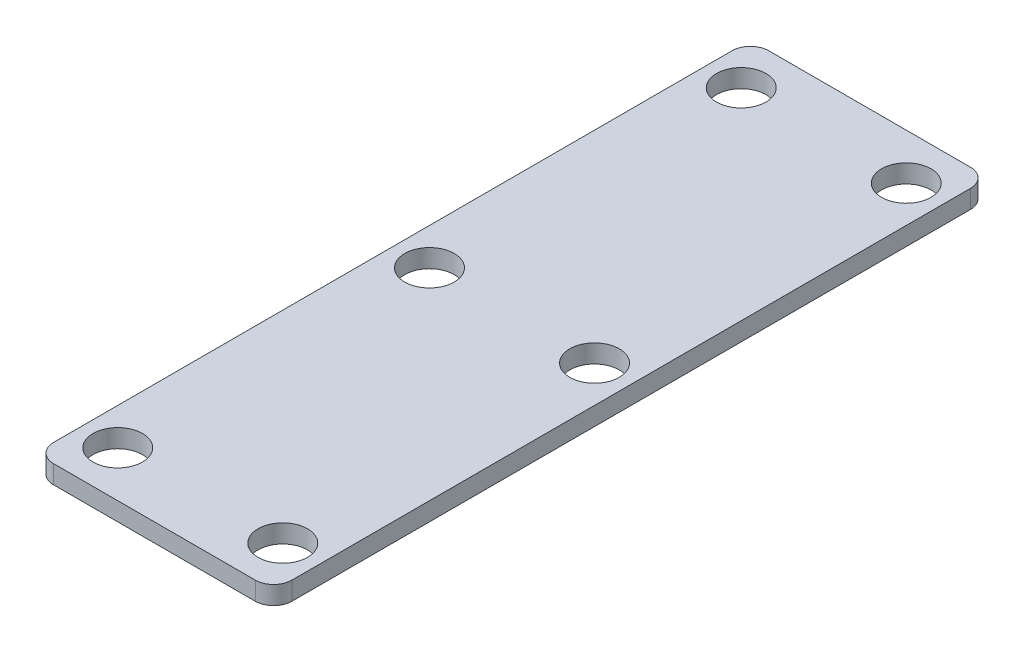
ISO-10303-21;
HEADER;
FILE_DESCRIPTION(('STEP AP214'),'2;1');
FILE_NAME('part.step','',(''),(''),'','','');
FILE_SCHEMA(('AUTOMOTIVE_DESIGN { 1 0 10303 214 1 1 1 1 }'));
ENDSEC;
DATA;
#1=APPLICATION_CONTEXT('core data for automotive mechanical design processes');
#2=APPLICATION_PROTOCOL_DEFINITION('international standard','automotive_design',2000,#1);
#3=PRODUCT_CONTEXT('',#1,'mechanical');
#4=PRODUCT('Part','Part','',(#3));
#5=PRODUCT_RELATED_PRODUCT_CATEGORY('part','',(#4));
#6=PRODUCT_DEFINITION_FORMATION('','',#4);
#7=PRODUCT_DEFINITION_CONTEXT('part definition',#1,'design');
#8=PRODUCT_DEFINITION('design','',#6,#7);
#9=PRODUCT_DEFINITION_SHAPE('','',#8);
#10=(LENGTH_UNIT() NAMED_UNIT(*) SI_UNIT(.MILLI.,.METRE.));
#11=(NAMED_UNIT(*) PLANE_ANGLE_UNIT() SI_UNIT($,.RADIAN.));
#12=(NAMED_UNIT(*) SI_UNIT($,.STERADIAN.) SOLID_ANGLE_UNIT());
#13=UNCERTAINTY_MEASURE_WITH_UNIT(LENGTH_MEASURE(1.E-05),#10,'distance_accuracy_value','');
#14=(GEOMETRIC_REPRESENTATION_CONTEXT(3) GLOBAL_UNCERTAINTY_ASSIGNED_CONTEXT((#13)) GLOBAL_UNIT_ASSIGNED_CONTEXT((#10,
#11,#12)) REPRESENTATION_CONTEXT('',''));
#15=CARTESIAN_POINT('',(0.,0.,0.));
#16=DIRECTION('',(0.,0.,1.));
#17=DIRECTION('',(1.,0.,0.));
#18=AXIS2_PLACEMENT_3D('',#15,#16,#17);
#19=CARTESIAN_POINT('',(6.5,1.,19.5));
#20=DIRECTION('',(-1.,0.,0.));
#21=DIRECTION('',(0.,0.,1.));
#22=AXIS2_PLACEMENT_3D('',#19,#20,#21);
#23=PLANE('',#22);
#24=DIRECTION('',(0.,0.,-1.));
#25=VECTOR('',#24,1.);
#26=CARTESIAN_POINT('',(6.5,1.,19.5));
#27=LINE('',#26,#25);
#28=CARTESIAN_POINT('',(6.5,1.,18.5));
#29=VERTEX_POINT('',#28);
#30=CARTESIAN_POINT('',(6.5,1.,-18.5));
#31=VERTEX_POINT('',#30);
#32=EDGE_CURVE('E127',#29,#31,#27,.T.);
#33=ORIENTED_EDGE('',*,*,#32,.F.);
#34=DIRECTION('',(0.,-1.,0.));
#35=VECTOR('',#34,1.);
#36=CARTESIAN_POINT('',(6.5,1.,18.5));
#37=LINE('',#36,#35);
#38=CARTESIAN_POINT('',(6.5,0.,18.5));
#39=VERTEX_POINT('',#38);
#40=EDGE_CURVE('E153',#29,#39,#37,.T.);
#41=ORIENTED_EDGE('',*,*,#40,.T.);
#42=DIRECTION('',(0.,0.,-1.));
#43=VECTOR('',#42,1.);
#44=CARTESIAN_POINT('',(6.5,0.,19.5));
#45=LINE('',#44,#43);
#46=CARTESIAN_POINT('',(6.5,0.,-18.5));
#47=VERTEX_POINT('',#46);
#48=EDGE_CURVE('E159',#39,#47,#45,.T.);
#49=ORIENTED_EDGE('',*,*,#48,.T.);
#50=DIRECTION('',(0.,-1.,0.));
#51=VECTOR('',#50,1.);
#52=CARTESIAN_POINT('',(6.5,1.,-18.5));
#53=LINE('',#52,#51);
#54=EDGE_CURVE('E151',#47,#31,#53,.F.);
#55=ORIENTED_EDGE('',*,*,#54,.T.);
#56=EDGE_LOOP('',(#33,#41,#49,#55));
#57=FACE_BOUND('',#56,.T.);
#58=ADVANCED_FACE('F35',(#57),#23,.F.);
#59=CARTESIAN_POINT('',(-6.5,1.,-19.5));
#60=DIRECTION('',(0.,0.,1.));
#61=DIRECTION('',(1.,0.,0.));
#62=AXIS2_PLACEMENT_3D('',#59,#60,#61);
#63=PLANE('',#62);
#64=DIRECTION('',(-1.,0.,0.));
#65=VECTOR('',#64,1.);
#66=CARTESIAN_POINT('',(-6.5,1.,-19.5));
#67=LINE('',#66,#65);
#68=CARTESIAN_POINT('',(5.49999999999999,1.,-19.5));
#69=VERTEX_POINT('',#68);
#70=CARTESIAN_POINT('',(-5.5,1.,-19.5));
#71=VERTEX_POINT('',#70);
#72=EDGE_CURVE('E130',#69,#71,#67,.T.);
#73=ORIENTED_EDGE('',*,*,#72,.F.);
#74=DIRECTION('',(0.,-1.,0.));
#75=VECTOR('',#74,1.);
#76=CARTESIAN_POINT('',(5.5,1.,-19.5));
#77=LINE('',#76,#75);
#78=CARTESIAN_POINT('',(5.49999999999999,0.,-19.5));
#79=VERTEX_POINT('',#78);
#80=EDGE_CURVE('E11',#69,#79,#77,.T.);
#81=ORIENTED_EDGE('',*,*,#80,.T.);
#82=DIRECTION('',(-1.,0.,0.));
#83=VECTOR('',#82,1.);
#84=CARTESIAN_POINT('',(-6.5,0.,-19.5));
#85=LINE('',#84,#83);
#86=CARTESIAN_POINT('',(-5.5,0.,-19.5));
#87=VERTEX_POINT('',#86);
#88=EDGE_CURVE('E132',#79,#87,#85,.T.);
#89=ORIENTED_EDGE('',*,*,#88,.T.);
#90=DIRECTION('',(0.,-1.,0.));
#91=VECTOR('',#90,1.);
#92=CARTESIAN_POINT('',(-5.5,1.,-19.5));
#93=LINE('',#92,#91);
#94=EDGE_CURVE('E43',#87,#71,#93,.F.);
#95=ORIENTED_EDGE('',*,*,#94,.T.);
#96=EDGE_LOOP('',(#73,#81,#89,#95));
#97=FACE_BOUND('',#96,.T.);
#98=ADVANCED_FACE('F236',(#97),#63,.F.);
#99=CARTESIAN_POINT('',(-6.5,1.,19.5));
#100=DIRECTION('',(1.,0.,0.));
#101=DIRECTION('',(0.,0.,-1.));
#102=AXIS2_PLACEMENT_3D('',#99,#100,#101);
#103=PLANE('',#102);
#104=DIRECTION('',(0.,0.,1.));
#105=VECTOR('',#104,1.);
#106=CARTESIAN_POINT('',(-6.5,0.,19.5));
#107=LINE('',#106,#105);
#108=CARTESIAN_POINT('',(-6.5,0.,-18.5));
#109=VERTEX_POINT('',#108);
#110=CARTESIAN_POINT('',(-6.5,0.,18.5));
#111=VERTEX_POINT('',#110);
#112=EDGE_CURVE('E128',#109,#111,#107,.T.);
#113=ORIENTED_EDGE('',*,*,#112,.T.);
#114=DIRECTION('',(0.,-1.,0.));
#115=VECTOR('',#114,1.);
#116=CARTESIAN_POINT('',(-6.5,1.,18.5));
#117=LINE('',#116,#115);
#118=CARTESIAN_POINT('',(-6.5,1.,18.5));
#119=VERTEX_POINT('',#118);
#120=EDGE_CURVE('E106',#111,#119,#117,.F.);
#121=ORIENTED_EDGE('',*,*,#120,.T.);
#122=DIRECTION('',(0.,0.,1.));
#123=VECTOR('',#122,1.);
#124=CARTESIAN_POINT('',(-6.5,1.,19.5));
#125=LINE('',#124,#123);
#126=CARTESIAN_POINT('',(-6.5,1.,-18.5));
#127=VERTEX_POINT('',#126);
#128=EDGE_CURVE('E171',#127,#119,#125,.T.);
#129=ORIENTED_EDGE('',*,*,#128,.F.);
#130=DIRECTION('',(0.,-1.,0.));
#131=VECTOR('',#130,1.);
#132=CARTESIAN_POINT('',(-6.5,1.,-18.5));
#133=LINE('',#132,#131);
#134=EDGE_CURVE('E111',#127,#109,#133,.T.);
#135=ORIENTED_EDGE('',*,*,#134,.T.);
#136=EDGE_LOOP('',(#113,#121,#129,#135));
#137=FACE_BOUND('',#136,.T.);
#138=ADVANCED_FACE('F234',(#137),#103,.F.);
#139=CARTESIAN_POINT('',(-6.5,1.,19.5));
#140=DIRECTION('',(0.,0.,-1.));
#141=DIRECTION('',(-1.,0.,0.));
#142=AXIS2_PLACEMENT_3D('',#139,#140,#141);
#143=PLANE('',#142);
#144=DIRECTION('',(1.,0.,0.));
#145=VECTOR('',#144,1.);
#146=CARTESIAN_POINT('',(-6.5,1.,19.5));
#147=LINE('',#146,#145);
#148=CARTESIAN_POINT('',(-5.5,1.,19.5));
#149=VERTEX_POINT('',#148);
#150=CARTESIAN_POINT('',(5.49999999999999,1.,19.5));
#151=VERTEX_POINT('',#150);
#152=EDGE_CURVE('E121',#149,#151,#147,.T.);
#153=ORIENTED_EDGE('',*,*,#152,.F.);
#154=DIRECTION('',(0.,-1.,0.));
#155=VECTOR('',#154,1.);
#156=CARTESIAN_POINT('',(-5.5,1.,19.5));
#157=LINE('',#156,#155);
#158=CARTESIAN_POINT('',(-5.5,0.,19.5));
#159=VERTEX_POINT('',#158);
#160=EDGE_CURVE('E105',#149,#159,#157,.T.);
#161=ORIENTED_EDGE('',*,*,#160,.T.);
#162=DIRECTION('',(1.,0.,0.));
#163=VECTOR('',#162,1.);
#164=CARTESIAN_POINT('',(-6.5,0.,19.5));
#165=LINE('',#164,#163);
#166=CARTESIAN_POINT('',(5.49999999999999,0.,19.5));
#167=VERTEX_POINT('',#166);
#168=EDGE_CURVE('E118',#159,#167,#165,.T.);
#169=ORIENTED_EDGE('',*,*,#168,.T.);
#170=DIRECTION('',(0.,-1.,0.));
#171=VECTOR('',#170,1.);
#172=CARTESIAN_POINT('',(5.5,1.,19.5));
#173=LINE('',#172,#171);
#174=EDGE_CURVE('E123',#167,#151,#173,.F.);
#175=ORIENTED_EDGE('',*,*,#174,.T.);
#176=EDGE_LOOP('',(#153,#161,#169,#175));
#177=FACE_BOUND('',#176,.T.);
#178=ADVANCED_FACE('F117',(#177),#143,.F.);
#179=CARTESIAN_POINT('',(0.,1.,0.));
#180=DIRECTION('',(0.,-1.,0.));
#181=DIRECTION('',(0.,0.,-1.));
#182=AXIS2_PLACEMENT_3D('',#179,#180,#181);
#183=PLANE('',#182);
#184=CARTESIAN_POINT('',(4.5,1.,17.));
#185=DIRECTION('',(0.,1.,0.));
#186=DIRECTION('',(0.,0.,1.));
#187=AXIS2_PLACEMENT_3D('',#184,#185,#186);
#188=CIRCLE('',#187,1.35);
#189=CARTESIAN_POINT('',(4.5,1.,18.35));
#190=VERTEX_POINT('',#189);
#191=EDGE_CURVE('E202',#190,#190,#188,.T.);
#192=ORIENTED_EDGE('',*,*,#191,.F.);
#193=EDGE_LOOP('',(#192));
#194=FACE_BOUND('',#193,.T.);
#195=CARTESIAN_POINT('',(-4.5,1.,17.));
#196=DIRECTION('',(0.,1.,0.));
#197=DIRECTION('',(0.,0.,1.));
#198=AXIS2_PLACEMENT_3D('',#195,#196,#197);
#199=CIRCLE('',#198,1.35);
#200=CARTESIAN_POINT('',(-4.5,1.,18.35));
#201=VERTEX_POINT('',#200);
#202=EDGE_CURVE('E196',#201,#201,#199,.T.);
#203=ORIENTED_EDGE('',*,*,#202,.F.);
#204=EDGE_LOOP('',(#203));
#205=FACE_BOUND('',#204,.T.);
#206=CARTESIAN_POINT('',(-4.50000000000001,1.,-17.));
#207=DIRECTION('',(0.,1.,0.));
#208=DIRECTION('',(0.,0.,1.));
#209=AXIS2_PLACEMENT_3D('',#206,#207,#208);
#210=CIRCLE('',#209,1.35);
#211=CARTESIAN_POINT('',(-4.50000000000001,1.,-15.65));
#212=VERTEX_POINT('',#211);
#213=EDGE_CURVE('E190',#212,#212,#210,.T.);
#214=ORIENTED_EDGE('',*,*,#213,.F.);
#215=EDGE_LOOP('',(#214));
#216=FACE_BOUND('',#215,.T.);
#217=CARTESIAN_POINT('',(4.5,1.,-17.));
#218=DIRECTION('',(0.,1.,0.));
#219=DIRECTION('',(0.,0.,1.));
#220=AXIS2_PLACEMENT_3D('',#217,#218,#219);
#221=CIRCLE('',#220,1.35);
#222=CARTESIAN_POINT('',(4.5,1.,-15.65));
#223=VERTEX_POINT('',#222);
#224=EDGE_CURVE('E184',#223,#223,#221,.T.);
#225=ORIENTED_EDGE('',*,*,#224,.F.);
#226=EDGE_LOOP('',(#225));
#227=FACE_BOUND('',#226,.T.);
#228=CARTESIAN_POINT('',(4.5,1.,0.));
#229=DIRECTION('',(0.,1.,0.));
#230=DIRECTION('',(0.,0.,1.));
#231=AXIS2_PLACEMENT_3D('',#228,#229,#230);
#232=CIRCLE('',#231,1.35);
#233=CARTESIAN_POINT('',(4.5,1.,1.35));
#234=VERTEX_POINT('',#233);
#235=EDGE_CURVE('E178',#234,#234,#232,.T.);
#236=ORIENTED_EDGE('',*,*,#235,.F.);
#237=EDGE_LOOP('',(#236));
#238=FACE_BOUND('',#237,.T.);
#239=CARTESIAN_POINT('',(-4.5,1.,0.));
#240=DIRECTION('',(0.,1.,0.));
#241=DIRECTION('',(0.,0.,1.));
#242=AXIS2_PLACEMENT_3D('',#239,#240,#241);
#243=CIRCLE('',#242,1.35);
#244=CARTESIAN_POINT('',(-4.5,1.,1.35));
#245=VERTEX_POINT('',#244);
#246=EDGE_CURVE('E167',#245,#245,#243,.T.);
#247=ORIENTED_EDGE('',*,*,#246,.F.);
#248=EDGE_LOOP('',(#247));
#249=FACE_BOUND('',#248,.T.);
#250=ORIENTED_EDGE('',*,*,#128,.T.);
#251=CARTESIAN_POINT('',(-5.5,1.,18.5));
#252=DIRECTION('',(0.,-1.,0.));
#253=DIRECTION('',(0.,0.,-1.));
#254=AXIS2_PLACEMENT_3D('',#251,#252,#253);
#255=CIRCLE('',#254,1.);
#256=EDGE_CURVE('E149',#119,#149,#255,.F.);
#257=ORIENTED_EDGE('',*,*,#256,.T.);
#258=ORIENTED_EDGE('',*,*,#152,.T.);
#259=CARTESIAN_POINT('',(5.5,1.,18.5));
#260=DIRECTION('',(0.,-1.,0.));
#261=DIRECTION('',(0.,0.,-1.));
#262=AXIS2_PLACEMENT_3D('',#259,#260,#261);
#263=CIRCLE('',#262,1.);
#264=EDGE_CURVE('E147',#151,#29,#263,.F.);
#265=ORIENTED_EDGE('',*,*,#264,.T.);
#266=ORIENTED_EDGE('',*,*,#32,.T.);
#267=CARTESIAN_POINT('',(5.5,1.,-18.5));
#268=DIRECTION('',(0.,-1.,0.));
#269=DIRECTION('',(0.,0.,-1.));
#270=AXIS2_PLACEMENT_3D('',#267,#268,#269);
#271=CIRCLE('',#270,1.);
#272=EDGE_CURVE('E56',#31,#69,#271,.F.);
#273=ORIENTED_EDGE('',*,*,#272,.T.);
#274=ORIENTED_EDGE('',*,*,#72,.T.);
#275=CARTESIAN_POINT('',(-5.5,1.,-18.5));
#276=DIRECTION('',(0.,-1.,0.));
#277=DIRECTION('',(0.,0.,-1.));
#278=AXIS2_PLACEMENT_3D('',#275,#276,#277);
#279=CIRCLE('',#278,1.);
#280=EDGE_CURVE('E144',#71,#127,#279,.F.);
#281=ORIENTED_EDGE('',*,*,#280,.T.);
#282=EDGE_LOOP('',(#250,#257,#258,#265,#266,#273,#274,#281));
#283=FACE_BOUND('',#282,.T.);
#284=ADVANCED_FACE('F217',(#194,#205,#216,#227,#238,#249,#283),#183,.F.);
#285=CARTESIAN_POINT('',(0.,0.,0.));
#286=DIRECTION('',(0.,-1.,0.));
#287=DIRECTION('',(0.,0.,-1.));
#288=AXIS2_PLACEMENT_3D('',#285,#286,#287);
#289=PLANE('',#288);
#290=CARTESIAN_POINT('',(4.5,0.,17.));
#291=DIRECTION('',(0.,1.,0.));
#292=DIRECTION('',(0.,0.,1.));
#293=AXIS2_PLACEMENT_3D('',#290,#291,#292);
#294=CIRCLE('',#293,1.35);
#295=CARTESIAN_POINT('',(4.5,0.,18.35));
#296=VERTEX_POINT('',#295);
#297=EDGE_CURVE('E199',#296,#296,#294,.T.);
#298=ORIENTED_EDGE('',*,*,#297,.T.);
#299=EDGE_LOOP('',(#298));
#300=FACE_BOUND('',#299,.T.);
#301=CARTESIAN_POINT('',(-4.5,0.,17.));
#302=DIRECTION('',(0.,1.,0.));
#303=DIRECTION('',(0.,0.,1.));
#304=AXIS2_PLACEMENT_3D('',#301,#302,#303);
#305=CIRCLE('',#304,1.35);
#306=CARTESIAN_POINT('',(-4.5,0.,18.35));
#307=VERTEX_POINT('',#306);
#308=EDGE_CURVE('E193',#307,#307,#305,.T.);
#309=ORIENTED_EDGE('',*,*,#308,.T.);
#310=EDGE_LOOP('',(#309));
#311=FACE_BOUND('',#310,.T.);
#312=CARTESIAN_POINT('',(-4.50000000000001,0.,-17.));
#313=DIRECTION('',(0.,1.,0.));
#314=DIRECTION('',(0.,0.,1.));
#315=AXIS2_PLACEMENT_3D('',#312,#313,#314);
#316=CIRCLE('',#315,1.35);
#317=CARTESIAN_POINT('',(-4.50000000000001,0.,-15.65));
#318=VERTEX_POINT('',#317);
#319=EDGE_CURVE('E187',#318,#318,#316,.T.);
#320=ORIENTED_EDGE('',*,*,#319,.T.);
#321=EDGE_LOOP('',(#320));
#322=FACE_BOUND('',#321,.T.);
#323=CARTESIAN_POINT('',(4.5,0.,-17.));
#324=DIRECTION('',(0.,1.,0.));
#325=DIRECTION('',(0.,0.,1.));
#326=AXIS2_PLACEMENT_3D('',#323,#324,#325);
#327=CIRCLE('',#326,1.35);
#328=CARTESIAN_POINT('',(4.5,0.,-15.65));
#329=VERTEX_POINT('',#328);
#330=EDGE_CURVE('E181',#329,#329,#327,.T.);
#331=ORIENTED_EDGE('',*,*,#330,.T.);
#332=EDGE_LOOP('',(#331));
#333=FACE_BOUND('',#332,.T.);
#334=CARTESIAN_POINT('',(4.5,0.,0.));
#335=DIRECTION('',(0.,1.,0.));
#336=DIRECTION('',(0.,0.,1.));
#337=AXIS2_PLACEMENT_3D('',#334,#335,#336);
#338=CIRCLE('',#337,1.35);
#339=CARTESIAN_POINT('',(4.5,0.,1.35));
#340=VERTEX_POINT('',#339);
#341=EDGE_CURVE('E176',#340,#340,#338,.T.);
#342=ORIENTED_EDGE('',*,*,#341,.T.);
#343=EDGE_LOOP('',(#342));
#344=FACE_BOUND('',#343,.T.);
#345=CARTESIAN_POINT('',(-4.5,0.,0.));
#346=DIRECTION('',(0.,1.,0.));
#347=DIRECTION('',(0.,0.,1.));
#348=AXIS2_PLACEMENT_3D('',#345,#346,#347);
#349=CIRCLE('',#348,1.35);
#350=CARTESIAN_POINT('',(-4.5,0.,1.35));
#351=VERTEX_POINT('',#350);
#352=EDGE_CURVE('E164',#351,#351,#349,.T.);
#353=ORIENTED_EDGE('',*,*,#352,.T.);
#354=EDGE_LOOP('',(#353));
#355=FACE_BOUND('',#354,.T.);
#356=ORIENTED_EDGE('',*,*,#168,.F.);
#357=CARTESIAN_POINT('',(-5.5,0.,18.5));
#358=DIRECTION('',(0.,-1.,0.));
#359=DIRECTION('',(0.,0.,-1.));
#360=AXIS2_PLACEMENT_3D('',#357,#358,#359);
#361=CIRCLE('',#360,1.);
#362=EDGE_CURVE('E101',#159,#111,#361,.T.);
#363=ORIENTED_EDGE('',*,*,#362,.T.);
#364=ORIENTED_EDGE('',*,*,#112,.F.);
#365=CARTESIAN_POINT('',(-5.5,0.,-18.5));
#366=DIRECTION('',(0.,-1.,0.));
#367=DIRECTION('',(0.,0.,-1.));
#368=AXIS2_PLACEMENT_3D('',#365,#366,#367);
#369=CIRCLE('',#368,1.);
#370=EDGE_CURVE('E122',#109,#87,#369,.T.);
#371=ORIENTED_EDGE('',*,*,#370,.T.);
#372=ORIENTED_EDGE('',*,*,#88,.F.);
#373=CARTESIAN_POINT('',(5.5,0.,-18.5));
#374=DIRECTION('',(0.,-1.,0.));
#375=DIRECTION('',(0.,0.,-1.));
#376=AXIS2_PLACEMENT_3D('',#373,#374,#375);
#377=CIRCLE('',#376,1.);
#378=EDGE_CURVE('E138',#79,#47,#377,.T.);
#379=ORIENTED_EDGE('',*,*,#378,.T.);
#380=ORIENTED_EDGE('',*,*,#48,.F.);
#381=CARTESIAN_POINT('',(5.5,0.,18.5));
#382=DIRECTION('',(0.,-1.,0.));
#383=DIRECTION('',(0.,0.,-1.));
#384=AXIS2_PLACEMENT_3D('',#381,#382,#383);
#385=CIRCLE('',#384,1.);
#386=EDGE_CURVE('E112',#39,#167,#385,.T.);
#387=ORIENTED_EDGE('',*,*,#386,.T.);
#388=EDGE_LOOP('',(#356,#363,#364,#371,#372,#379,#380,#387));
#389=FACE_BOUND('',#388,.T.);
#390=ADVANCED_FACE('F125',(#300,#311,#322,#333,#344,#355,#389),#289,.T.);
#391=CARTESIAN_POINT('',(-4.5,0.,0.));
#392=DIRECTION('',(0.,1.,0.));
#393=DIRECTION('',(0.,0.,1.));
#394=AXIS2_PLACEMENT_3D('',#391,#392,#393);
#395=CYLINDRICAL_SURFACE('',#394,1.35);
#396=ORIENTED_EDGE('',*,*,#352,.F.);
#397=EDGE_LOOP('',(#396));
#398=FACE_BOUND('',#397,.T.);
#399=ORIENTED_EDGE('',*,*,#246,.T.);
#400=EDGE_LOOP('',(#399));
#401=FACE_BOUND('',#400,.T.);
#402=ADVANCED_FACE('F260',(#398,#401),#395,.F.);
#403=CARTESIAN_POINT('',(4.5,0.,0.));
#404=DIRECTION('',(0.,1.,0.));
#405=DIRECTION('',(0.,0.,1.));
#406=AXIS2_PLACEMENT_3D('',#403,#404,#405);
#407=CYLINDRICAL_SURFACE('',#406,1.35);
#408=ORIENTED_EDGE('',*,*,#341,.F.);
#409=EDGE_LOOP('',(#408));
#410=FACE_BOUND('',#409,.T.);
#411=ORIENTED_EDGE('',*,*,#235,.T.);
#412=EDGE_LOOP('',(#411));
#413=FACE_BOUND('',#412,.T.);
#414=ADVANCED_FACE('F264',(#410,#413),#407,.F.);
#415=CARTESIAN_POINT('',(4.5,0.,-17.));
#416=DIRECTION('',(0.,1.,0.));
#417=DIRECTION('',(0.,0.,1.));
#418=AXIS2_PLACEMENT_3D('',#415,#416,#417);
#419=CYLINDRICAL_SURFACE('',#418,1.35);
#420=ORIENTED_EDGE('',*,*,#330,.F.);
#421=EDGE_LOOP('',(#420));
#422=FACE_BOUND('',#421,.T.);
#423=ORIENTED_EDGE('',*,*,#224,.T.);
#424=EDGE_LOOP('',(#423));
#425=FACE_BOUND('',#424,.T.);
#426=ADVANCED_FACE('F268',(#422,#425),#419,.F.);
#427=CARTESIAN_POINT('',(-4.50000000000001,0.,-17.));
#428=DIRECTION('',(0.,1.,0.));
#429=DIRECTION('',(0.,0.,1.));
#430=AXIS2_PLACEMENT_3D('',#427,#428,#429);
#431=CYLINDRICAL_SURFACE('',#430,1.35);
#432=ORIENTED_EDGE('',*,*,#319,.F.);
#433=EDGE_LOOP('',(#432));
#434=FACE_BOUND('',#433,.T.);
#435=ORIENTED_EDGE('',*,*,#213,.T.);
#436=EDGE_LOOP('',(#435));
#437=FACE_BOUND('',#436,.T.);
#438=ADVANCED_FACE('F272',(#434,#437),#431,.F.);
#439=CARTESIAN_POINT('',(-4.5,0.,17.));
#440=DIRECTION('',(0.,1.,0.));
#441=DIRECTION('',(0.,0.,1.));
#442=AXIS2_PLACEMENT_3D('',#439,#440,#441);
#443=CYLINDRICAL_SURFACE('',#442,1.35);
#444=ORIENTED_EDGE('',*,*,#308,.F.);
#445=EDGE_LOOP('',(#444));
#446=FACE_BOUND('',#445,.T.);
#447=ORIENTED_EDGE('',*,*,#202,.T.);
#448=EDGE_LOOP('',(#447));
#449=FACE_BOUND('',#448,.T.);
#450=ADVANCED_FACE('F213',(#446,#449),#443,.F.);
#451=CARTESIAN_POINT('',(4.5,0.,17.));
#452=DIRECTION('',(0.,1.,0.));
#453=DIRECTION('',(0.,0.,1.));
#454=AXIS2_PLACEMENT_3D('',#451,#452,#453);
#455=CYLINDRICAL_SURFACE('',#454,1.35);
#456=ORIENTED_EDGE('',*,*,#297,.F.);
#457=EDGE_LOOP('',(#456));
#458=FACE_BOUND('',#457,.T.);
#459=ORIENTED_EDGE('',*,*,#191,.T.);
#460=EDGE_LOOP('',(#459));
#461=FACE_BOUND('',#460,.T.);
#462=ADVANCED_FACE('F210',(#458,#461),#455,.F.);
#463=CARTESIAN_POINT('',(-5.5,1.,18.5));
#464=DIRECTION('',(0.,-1.,0.));
#465=DIRECTION('',(0.,0.,-1.));
#466=AXIS2_PLACEMENT_3D('',#463,#464,#465);
#467=CYLINDRICAL_SURFACE('',#466,1.);
#468=ORIENTED_EDGE('',*,*,#256,.F.);
#469=ORIENTED_EDGE('',*,*,#120,.F.);
#470=ORIENTED_EDGE('',*,*,#362,.F.);
#471=ORIENTED_EDGE('',*,*,#160,.F.);
#472=EDGE_LOOP('',(#468,#469,#470,#471));
#473=FACE_BOUND('',#472,.T.);
#474=ADVANCED_FACE('F104',(#473),#467,.T.);
#475=CARTESIAN_POINT('',(5.5,1.,18.5));
#476=DIRECTION('',(0.,-1.,0.));
#477=DIRECTION('',(0.,0.,-1.));
#478=AXIS2_PLACEMENT_3D('',#475,#476,#477);
#479=CYLINDRICAL_SURFACE('',#478,1.);
#480=ORIENTED_EDGE('',*,*,#264,.F.);
#481=ORIENTED_EDGE('',*,*,#174,.F.);
#482=ORIENTED_EDGE('',*,*,#386,.F.);
#483=ORIENTED_EDGE('',*,*,#40,.F.);
#484=EDGE_LOOP('',(#480,#481,#482,#483));
#485=FACE_BOUND('',#484,.T.);
#486=ADVANCED_FACE('F240',(#485),#479,.T.);
#487=CARTESIAN_POINT('',(5.5,1.,-18.5));
#488=DIRECTION('',(0.,-1.,0.));
#489=DIRECTION('',(0.,0.,-1.));
#490=AXIS2_PLACEMENT_3D('',#487,#488,#489);
#491=CYLINDRICAL_SURFACE('',#490,1.);
#492=ORIENTED_EDGE('',*,*,#272,.F.);
#493=ORIENTED_EDGE('',*,*,#54,.F.);
#494=ORIENTED_EDGE('',*,*,#378,.F.);
#495=ORIENTED_EDGE('',*,*,#80,.F.);
#496=EDGE_LOOP('',(#492,#493,#494,#495));
#497=FACE_BOUND('',#496,.T.);
#498=ADVANCED_FACE('F239',(#497),#491,.T.);
#499=CARTESIAN_POINT('',(-5.5,1.,-18.5));
#500=DIRECTION('',(0.,-1.,0.));
#501=DIRECTION('',(0.,0.,-1.));
#502=AXIS2_PLACEMENT_3D('',#499,#500,#501);
#503=CYLINDRICAL_SURFACE('',#502,1.);
#504=ORIENTED_EDGE('',*,*,#280,.F.);
#505=ORIENTED_EDGE('',*,*,#94,.F.);
#506=ORIENTED_EDGE('',*,*,#370,.F.);
#507=ORIENTED_EDGE('',*,*,#134,.F.);
#508=EDGE_LOOP('',(#504,#505,#506,#507));
#509=FACE_BOUND('',#508,.T.);
#510=ADVANCED_FACE('F37',(#509),#503,.T.);
#511=CLOSED_SHELL('',(#58,#98,#138,#178,#284,#390,#402,#414,#426,#438,#450,#462,#474,#486,#498,#510));
#512=MANIFOLD_SOLID_BREP('B2',#511);
#513=ADVANCED_BREP_SHAPE_REPRESENTATION('',(#18,#512),#14);
#514=SHAPE_DEFINITION_REPRESENTATION(#9,#513);
ENDSEC;
END-ISO-10303-21;
